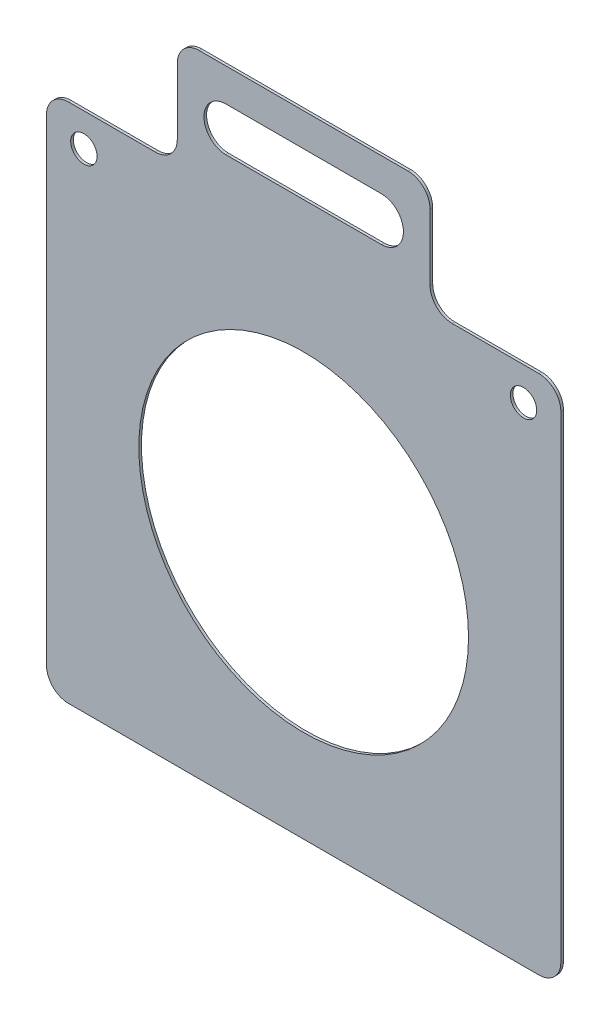
ISO-10303-21;
HEADER;
FILE_DESCRIPTION(('STEP AP214'),'2;1');
FILE_NAME('part.step','',(''),(''),'','','');
FILE_SCHEMA(('AUTOMOTIVE_DESIGN { 1 0 10303 214 1 1 1 1 }'));
ENDSEC;
DATA;
#1=APPLICATION_CONTEXT('core data for automotive mechanical design processes');
#2=APPLICATION_PROTOCOL_DEFINITION('international standard','automotive_design',2000,#1);
#3=PRODUCT_CONTEXT('',#1,'mechanical');
#4=PRODUCT('Part','Part','',(#3));
#5=PRODUCT_RELATED_PRODUCT_CATEGORY('part','',(#4));
#6=PRODUCT_DEFINITION_FORMATION('','',#4);
#7=PRODUCT_DEFINITION_CONTEXT('part definition',#1,'design');
#8=PRODUCT_DEFINITION('design','',#6,#7);
#9=PRODUCT_DEFINITION_SHAPE('','',#8);
#10=(LENGTH_UNIT() NAMED_UNIT(*) SI_UNIT(.MILLI.,.METRE.));
#11=(NAMED_UNIT(*) PLANE_ANGLE_UNIT() SI_UNIT($,.RADIAN.));
#12=(NAMED_UNIT(*) SI_UNIT($,.STERADIAN.) SOLID_ANGLE_UNIT());
#13=UNCERTAINTY_MEASURE_WITH_UNIT(LENGTH_MEASURE(1.E-05),#10,'distance_accuracy_value','');
#14=(GEOMETRIC_REPRESENTATION_CONTEXT(3) GLOBAL_UNCERTAINTY_ASSIGNED_CONTEXT((#13)) GLOBAL_UNIT_ASSIGNED_CONTEXT((#10,
#11,#12)) REPRESENTATION_CONTEXT('',''));
#15=CARTESIAN_POINT('',(0.,0.,0.));
#16=DIRECTION('',(0.,0.,1.));
#17=DIRECTION('',(1.,0.,0.));
#18=AXIS2_PLACEMENT_3D('',#15,#16,#17);
#19=CARTESIAN_POINT('',(-117.,120.000000000001,1.20000000000005));
#20=DIRECTION('',(0.,-1.,0.));
#21=DIRECTION('',(1.,0.,0.));
#22=AXIS2_PLACEMENT_3D('',#19,#20,#21);
#23=PLANE('',#22);
#24=DIRECTION('',(-1.,0.,0.));
#25=VECTOR('',#24,1.);
#26=CARTESIAN_POINT('',(-117.,120.000000000001,1.20000000000005));
#27=LINE('',#26,#25);
#28=CARTESIAN_POINT('',(-67.5000000000001,120.000000000001,1.20000000000005));
#29=VERTEX_POINT('',#28);
#30=CARTESIAN_POINT('',(-107.,120.,1.20000000000005));
#31=VERTEX_POINT('',#30);
#32=EDGE_CURVE('E276',#29,#31,#27,.T.);
#33=ORIENTED_EDGE('',*,*,#32,.F.);
#34=DIRECTION('',(0.,0.,1.));
#35=VECTOR('',#34,1.);
#36=CARTESIAN_POINT('',(-67.5000000000001,120.000000000001,1.20000000000005));
#37=LINE('',#36,#35);
#38=CARTESIAN_POINT('',(-67.5000000000001,120.000000000001,0.));
#39=VERTEX_POINT('',#38);
#40=EDGE_CURVE('E361',#29,#39,#37,.F.);
#41=ORIENTED_EDGE('',*,*,#40,.T.);
#42=DIRECTION('',(-1.,0.,0.));
#43=VECTOR('',#42,1.);
#44=CARTESIAN_POINT('',(-117.,120.000000000001,0.));
#45=LINE('',#44,#43);
#46=CARTESIAN_POINT('',(-107.,120.,0.));
#47=VERTEX_POINT('',#46);
#48=EDGE_CURVE('E291',#39,#47,#45,.T.);
#49=ORIENTED_EDGE('',*,*,#48,.T.);
#50=DIRECTION('',(0.,0.,-1.));
#51=VECTOR('',#50,1.);
#52=CARTESIAN_POINT('',(-107.,120.,1.20000000000005));
#53=LINE('',#52,#51);
#54=EDGE_CURVE('E358',#47,#31,#53,.F.);
#55=ORIENTED_EDGE('',*,*,#54,.T.);
#56=EDGE_LOOP('',(#33,#41,#49,#55));
#57=FACE_BOUND('',#56,.T.);
#58=ADVANCED_FACE('F40',(#57),#23,.F.);
#59=CARTESIAN_POINT('',(0.,0.,1.19999999999998));
#60=DIRECTION('',(0.,0.,1.));
#61=DIRECTION('',(1.,0.,0.));
#62=AXIS2_PLACEMENT_3D('',#59,#60,#61);
#63=PLANE('',#62);
#64=CARTESIAN_POINT('',(-100.,105.,1.20000000000005));
#65=DIRECTION('',(0.,0.,1.));
#66=DIRECTION('',(1.,0.,0.));
#67=AXIS2_PLACEMENT_3D('',#64,#65,#66);
#68=CIRCLE('',#67,6.);
#69=CARTESIAN_POINT('',(-94.0000000000003,105.,1.20000000000005));
#70=VERTEX_POINT('',#69);
#71=EDGE_CURVE('E247',#70,#70,#68,.T.);
#72=ORIENTED_EDGE('',*,*,#71,.F.);
#73=EDGE_LOOP('',(#72));
#74=FACE_BOUND('',#73,.T.);
#75=DIRECTION('',(0.,1.,0.));
#76=VECTOR('',#75,1.);
#77=CARTESIAN_POINT('',(57.5000000000002,170.000000000002,1.19999999999999));
#78=LINE('',#77,#76);
#79=CARTESIAN_POINT('',(57.5000000000003,130.000000000001,1.19999999999999));
#80=VERTEX_POINT('',#79);
#81=CARTESIAN_POINT('',(57.5000000000001,160.000000000002,1.19999999999999));
#82=VERTEX_POINT('',#81);
#83=EDGE_CURVE('E217',#80,#82,#78,.T.);
#84=ORIENTED_EDGE('',*,*,#83,.T.);
#85=CARTESIAN_POINT('',(47.5,160.000000000002,1.20000000000005));
#86=DIRECTION('',(0.,0.,1.));
#87=DIRECTION('',(1.,0.,0.));
#88=AXIS2_PLACEMENT_3D('',#85,#86,#87);
#89=CIRCLE('',#88,10.);
#90=CARTESIAN_POINT('',(47.5000000000002,170.000000000002,1.19999999999999));
#91=VERTEX_POINT('',#90);
#92=EDGE_CURVE('E325',#82,#91,#89,.T.);
#93=ORIENTED_EDGE('',*,*,#92,.T.);
#94=DIRECTION('',(-1.,0.,0.));
#95=VECTOR('',#94,1.);
#96=CARTESIAN_POINT('',(-57.5000000000002,170.000000000002,1.20000000000005));
#97=LINE('',#96,#95);
#98=CARTESIAN_POINT('',(-47.5000000000001,170.000000000002,1.20000000000005));
#99=VERTEX_POINT('',#98);
#100=EDGE_CURVE('E225',#91,#99,#97,.T.);
#101=ORIENTED_EDGE('',*,*,#100,.T.);
#102=CARTESIAN_POINT('',(-47.5,160.000000000002,1.20000000000005));
#103=DIRECTION('',(0.,0.,1.));
#104=DIRECTION('',(1.,0.,0.));
#105=AXIS2_PLACEMENT_3D('',#102,#103,#104);
#106=CIRCLE('',#105,10.);
#107=CARTESIAN_POINT('',(-57.5,160.000000000002,1.20000000000005));
#108=VERTEX_POINT('',#107);
#109=EDGE_CURVE('E322',#99,#108,#106,.T.);
#110=ORIENTED_EDGE('',*,*,#109,.T.);
#111=DIRECTION('',(0.,-1.,0.));
#112=VECTOR('',#111,1.);
#113=CARTESIAN_POINT('',(-57.4999999999999,120.000000000002,1.20000000000005));
#114=LINE('',#113,#112);
#115=CARTESIAN_POINT('',(-57.5000000000001,130.000000000001,1.19999999999998));
#116=VERTEX_POINT('',#115);
#117=EDGE_CURVE('E229',#108,#116,#114,.T.);
#118=ORIENTED_EDGE('',*,*,#117,.T.);
#119=CARTESIAN_POINT('',(-67.5,130.000000000001,1.19999999999998));
#120=DIRECTION('',(0.,0.,1.));
#121=DIRECTION('',(1.,0.,0.));
#122=AXIS2_PLACEMENT_3D('',#119,#120,#121);
#123=CIRCLE('',#122,10.);
#124=EDGE_CURVE('E49',#116,#29,#123,.F.);
#125=ORIENTED_EDGE('',*,*,#124,.T.);
#126=ORIENTED_EDGE('',*,*,#32,.T.);
#127=CARTESIAN_POINT('',(-107.,110.,1.20000000000005));
#128=DIRECTION('',(0.,0.,1.));
#129=DIRECTION('',(1.,0.,0.));
#130=AXIS2_PLACEMENT_3D('',#127,#128,#129);
#131=CIRCLE('',#130,10.);
#132=CARTESIAN_POINT('',(-117.,110.,1.20000000000005));
#133=VERTEX_POINT('',#132);
#134=EDGE_CURVE('E319',#31,#133,#131,.T.);
#135=ORIENTED_EDGE('',*,*,#134,.T.);
#136=DIRECTION('',(0.,-1.,0.));
#137=VECTOR('',#136,1.);
#138=CARTESIAN_POINT('',(-117.,120.000000000001,1.20000000000005));
#139=LINE('',#138,#137);
#140=CARTESIAN_POINT('',(-117.,-107.,1.20000000000003));
#141=VERTEX_POINT('',#140);
#142=EDGE_CURVE('E263',#133,#141,#139,.T.);
#143=ORIENTED_EDGE('',*,*,#142,.T.);
#144=CARTESIAN_POINT('',(-107.,-107.,1.20000000000003));
#145=DIRECTION('',(0.,0.,1.));
#146=DIRECTION('',(1.,0.,0.));
#147=AXIS2_PLACEMENT_3D('',#144,#145,#146);
#148=CIRCLE('',#147,10.);
#149=CARTESIAN_POINT('',(-107.,-117.,1.20000000000003));
#150=VERTEX_POINT('',#149);
#151=EDGE_CURVE('E313',#141,#150,#148,.T.);
#152=ORIENTED_EDGE('',*,*,#151,.T.);
#153=DIRECTION('',(1.,0.,0.));
#154=VECTOR('',#153,1.);
#155=CARTESIAN_POINT('',(-117.,-117.,1.20000000000003));
#156=LINE('',#155,#154);
#157=CARTESIAN_POINT('',(107.,-117.,1.19999999999998));
#158=VERTEX_POINT('',#157);
#159=EDGE_CURVE('E267',#150,#158,#156,.T.);
#160=ORIENTED_EDGE('',*,*,#159,.T.);
#161=CARTESIAN_POINT('',(107.,-107.,1.19999999999998));
#162=DIRECTION('',(0.,0.,1.));
#163=DIRECTION('',(1.,0.,0.));
#164=AXIS2_PLACEMENT_3D('',#161,#162,#163);
#165=CIRCLE('',#164,10.);
#166=CARTESIAN_POINT('',(117.,-107.,1.19999999999998));
#167=VERTEX_POINT('',#166);
#168=EDGE_CURVE('E316',#158,#167,#165,.T.);
#169=ORIENTED_EDGE('',*,*,#168,.T.);
#170=DIRECTION('',(0.,1.,0.));
#171=VECTOR('',#170,1.);
#172=CARTESIAN_POINT('',(117.,120.000000000001,1.19999999999998));
#173=LINE('',#172,#171);
#174=CARTESIAN_POINT('',(117.,110.,1.19999999999998));
#175=VERTEX_POINT('',#174);
#176=EDGE_CURVE('E272',#167,#175,#173,.T.);
#177=ORIENTED_EDGE('',*,*,#176,.T.);
#178=CARTESIAN_POINT('',(107.,110.000000000001,1.19999999999998));
#179=DIRECTION('',(0.,0.,1.));
#180=DIRECTION('',(1.,0.,0.));
#181=AXIS2_PLACEMENT_3D('',#178,#179,#180);
#182=CIRCLE('',#181,10.);
#183=CARTESIAN_POINT('',(107.,120.000000000001,1.19999999999998));
#184=VERTEX_POINT('',#183);
#185=EDGE_CURVE('E310',#175,#184,#182,.T.);
#186=ORIENTED_EDGE('',*,*,#185,.T.);
#187=CARTESIAN_POINT('',(67.5000000000001,120.000000000001,1.19999999999998));
#188=VERTEX_POINT('',#187);
#189=EDGE_CURVE('E280',#184,#188,#27,.T.);
#190=ORIENTED_EDGE('',*,*,#189,.T.);
#191=CARTESIAN_POINT('',(67.5000000000003,130.000000000001,1.19999999999998));
#192=DIRECTION('',(0.,0.,1.));
#193=DIRECTION('',(1.,0.,0.));
#194=AXIS2_PLACEMENT_3D('',#191,#192,#193);
#195=CIRCLE('',#194,10.);
#196=EDGE_CURVE('E384',#188,#80,#195,.F.);
#197=ORIENTED_EDGE('',*,*,#196,.T.);
#198=EDGE_LOOP('',(#84,#93,#101,#110,#118,#125,#126,#135,#143,#152,#160,#169,#177,#186,#190,#197));
#199=FACE_BOUND('',#198,.T.);
#200=CARTESIAN_POINT('',(0.,0.,1.19999999999998));
#201=DIRECTION('',(0.,0.,1.));
#202=DIRECTION('',(1.,0.,0.));
#203=AXIS2_PLACEMENT_3D('',#200,#201,#202);
#204=CIRCLE('',#203,75.);
#205=CARTESIAN_POINT('',(75.0000000000002,0.,1.19999999999998));
#206=VERTEX_POINT('',#205);
#207=EDGE_CURVE('E255',#206,#206,#204,.T.);
#208=ORIENTED_EDGE('',*,*,#207,.F.);
#209=EDGE_LOOP('',(#208));
#210=FACE_BOUND('',#209,.T.);
#211=CARTESIAN_POINT('',(100.,105.000000000001,1.19999999999998));
#212=DIRECTION('',(0.,0.,1.));
#213=DIRECTION('',(-1.,0.,0.));
#214=AXIS2_PLACEMENT_3D('',#211,#212,#213);
#215=CIRCLE('',#214,6.);
#216=CARTESIAN_POINT('',(94.0000000000002,105.000000000001,1.19999999999998));
#217=VERTEX_POINT('',#216);
#218=EDGE_CURVE('E237',#217,#217,#215,.T.);
#219=ORIENTED_EDGE('',*,*,#218,.F.);
#220=EDGE_LOOP('',(#219));
#221=FACE_BOUND('',#220,.T.);
#222=DIRECTION('',(1.,0.,0.));
#223=VECTOR('',#222,1.);
#224=CARTESIAN_POINT('',(-35.3706002300001,134.999999999999,1.20000000000005));
#225=LINE('',#224,#223);
#226=CARTESIAN_POINT('',(-35.3706002300001,134.999999999999,1.20000000000005));
#227=VERTEX_POINT('',#226);
#228=CARTESIAN_POINT('',(35.3706002300002,135.,1.19999999999999));
#229=VERTEX_POINT('',#228);
#230=EDGE_CURVE('E195',#227,#229,#225,.T.);
#231=ORIENTED_EDGE('',*,*,#230,.F.);
#232=CARTESIAN_POINT('',(-35.3706002300002,145.000000000002,1.20000000000005));
#233=DIRECTION('',(0.,0.,1.));
#234=DIRECTION('',(1.,0.,0.));
#235=AXIS2_PLACEMENT_3D('',#232,#233,#234);
#236=CIRCLE('',#235,10.0000000000015);
#237=CARTESIAN_POINT('',(-35.3706002300001,155.000000000002,1.20000000000005));
#238=VERTEX_POINT('',#237);
#239=EDGE_CURVE('E202',#238,#227,#236,.T.);
#240=ORIENTED_EDGE('',*,*,#239,.F.);
#241=DIRECTION('',(-1.,0.,0.));
#242=VECTOR('',#241,1.);
#243=CARTESIAN_POINT('',(-35.3706002300001,155.000000000002,1.20000000000005));
#244=LINE('',#243,#242);
#245=CARTESIAN_POINT('',(35.3706002300001,155.000000000002,1.19999999999999));
#246=VERTEX_POINT('',#245);
#247=EDGE_CURVE('E206',#246,#238,#244,.T.);
#248=ORIENTED_EDGE('',*,*,#247,.F.);
#249=CARTESIAN_POINT('',(35.3706002300001,145.000000000002,1.19999999999999));
#250=DIRECTION('',(0.,0.,1.));
#251=DIRECTION('',(1.,0.,0.));
#252=AXIS2_PLACEMENT_3D('',#249,#250,#251);
#253=CIRCLE('',#252,10.0000000000015);
#254=EDGE_CURVE('E185',#229,#246,#253,.T.);
#255=ORIENTED_EDGE('',*,*,#254,.F.);
#256=EDGE_LOOP('',(#231,#240,#248,#255));
#257=FACE_BOUND('',#256,.T.);
#258=ADVANCED_FACE('F204',(#74,#199,#210,#221,#257),#63,.T.);
#259=CARTESIAN_POINT('',(0.,0.,0.));
#260=DIRECTION('',(0.,0.,1.));
#261=DIRECTION('',(1.,0.,0.));
#262=AXIS2_PLACEMENT_3D('',#259,#260,#261);
#263=PLANE('',#262);
#264=DIRECTION('',(1.,0.,0.));
#265=VECTOR('',#264,1.);
#266=CARTESIAN_POINT('',(-57.5000000000002,170.000000000002,0.));
#267=LINE('',#266,#265);
#268=CARTESIAN_POINT('',(-47.5000000000001,170.000000000002,0.));
#269=VERTEX_POINT('',#268);
#270=CARTESIAN_POINT('',(47.5000000000002,170.000000000002,0.));
#271=VERTEX_POINT('',#270);
#272=EDGE_CURVE('E236',#269,#271,#267,.T.);
#273=ORIENTED_EDGE('',*,*,#272,.T.);
#274=CARTESIAN_POINT('',(47.5,160.000000000002,0.));
#275=DIRECTION('',(0.,0.,1.));
#276=DIRECTION('',(1.,0.,0.));
#277=AXIS2_PLACEMENT_3D('',#274,#275,#276);
#278=CIRCLE('',#277,10.);
#279=CARTESIAN_POINT('',(57.5000000000001,160.000000000002,0.));
#280=VERTEX_POINT('',#279);
#281=EDGE_CURVE('E348',#271,#280,#278,.F.);
#282=ORIENTED_EDGE('',*,*,#281,.T.);
#283=DIRECTION('',(0.,-1.,0.));
#284=VECTOR('',#283,1.);
#285=CARTESIAN_POINT('',(57.5000000000002,170.000000000002,0.));
#286=LINE('',#285,#284);
#287=CARTESIAN_POINT('',(57.5000000000003,130.000000000001,0.));
#288=VERTEX_POINT('',#287);
#289=EDGE_CURVE('E246',#280,#288,#286,.T.);
#290=ORIENTED_EDGE('',*,*,#289,.T.);
#291=CARTESIAN_POINT('',(67.5000000000003,130.000000000001,0.));
#292=DIRECTION('',(0.,0.,1.));
#293=DIRECTION('',(1.,0.,0.));
#294=AXIS2_PLACEMENT_3D('',#291,#292,#293);
#295=CIRCLE('',#294,10.);
#296=CARTESIAN_POINT('',(67.5000000000001,120.000000000001,0.));
#297=VERTEX_POINT('',#296);
#298=EDGE_CURVE('E387',#288,#297,#295,.T.);
#299=ORIENTED_EDGE('',*,*,#298,.T.);
#300=CARTESIAN_POINT('',(107.,120.000000000001,0.));
#301=VERTEX_POINT('',#300);
#302=EDGE_CURVE('E268',#301,#297,#45,.T.);
#303=ORIENTED_EDGE('',*,*,#302,.F.);
#304=CARTESIAN_POINT('',(107.,110.000000000001,0.));
#305=DIRECTION('',(0.,0.,1.));
#306=DIRECTION('',(1.,0.,0.));
#307=AXIS2_PLACEMENT_3D('',#304,#305,#306);
#308=CIRCLE('',#307,10.);
#309=CARTESIAN_POINT('',(117.,110.,0.));
#310=VERTEX_POINT('',#309);
#311=EDGE_CURVE('E335',#301,#310,#308,.F.);
#312=ORIENTED_EDGE('',*,*,#311,.T.);
#313=DIRECTION('',(0.,1.,0.));
#314=VECTOR('',#313,1.);
#315=CARTESIAN_POINT('',(117.,120.000000000001,0.));
#316=LINE('',#315,#314);
#317=CARTESIAN_POINT('',(117.,-107.,0.));
#318=VERTEX_POINT('',#317);
#319=EDGE_CURVE('E287',#318,#310,#316,.T.);
#320=ORIENTED_EDGE('',*,*,#319,.F.);
#321=CARTESIAN_POINT('',(107.,-107.,0.));
#322=DIRECTION('',(0.,0.,1.));
#323=DIRECTION('',(1.,0.,0.));
#324=AXIS2_PLACEMENT_3D('',#321,#322,#323);
#325=CIRCLE('',#324,10.);
#326=CARTESIAN_POINT('',(107.,-117.,0.));
#327=VERTEX_POINT('',#326);
#328=EDGE_CURVE('E56',#318,#327,#325,.F.);
#329=ORIENTED_EDGE('',*,*,#328,.T.);
#330=DIRECTION('',(1.,0.,0.));
#331=VECTOR('',#330,1.);
#332=CARTESIAN_POINT('',(-117.,-117.,0.));
#333=LINE('',#332,#331);
#334=CARTESIAN_POINT('',(-107.,-117.,0.));
#335=VERTEX_POINT('',#334);
#336=EDGE_CURVE('E284',#335,#327,#333,.T.);
#337=ORIENTED_EDGE('',*,*,#336,.F.);
#338=CARTESIAN_POINT('',(-107.,-107.,0.));
#339=DIRECTION('',(0.,0.,1.));
#340=DIRECTION('',(1.,0.,0.));
#341=AXIS2_PLACEMENT_3D('',#338,#339,#340);
#342=CIRCLE('',#341,10.);
#343=CARTESIAN_POINT('',(-117.,-107.,0.));
#344=VERTEX_POINT('',#343);
#345=EDGE_CURVE('E64',#335,#344,#342,.F.);
#346=ORIENTED_EDGE('',*,*,#345,.T.);
#347=DIRECTION('',(0.,-1.,0.));
#348=VECTOR('',#347,1.);
#349=CARTESIAN_POINT('',(-117.,120.000000000001,0.));
#350=LINE('',#349,#348);
#351=CARTESIAN_POINT('',(-117.,110.,0.));
#352=VERTEX_POINT('',#351);
#353=EDGE_CURVE('E259',#352,#344,#350,.T.);
#354=ORIENTED_EDGE('',*,*,#353,.F.);
#355=CARTESIAN_POINT('',(-107.,110.,0.));
#356=DIRECTION('',(0.,0.,1.));
#357=DIRECTION('',(1.,0.,0.));
#358=AXIS2_PLACEMENT_3D('',#355,#356,#357);
#359=CIRCLE('',#358,10.);
#360=EDGE_CURVE('E342',#352,#47,#359,.F.);
#361=ORIENTED_EDGE('',*,*,#360,.T.);
#362=ORIENTED_EDGE('',*,*,#48,.F.);
#363=CARTESIAN_POINT('',(-67.5,130.000000000001,0.));
#364=DIRECTION('',(0.,0.,1.));
#365=DIRECTION('',(1.,0.,0.));
#366=AXIS2_PLACEMENT_3D('',#363,#364,#365);
#367=CIRCLE('',#366,10.);
#368=CARTESIAN_POINT('',(-57.5000000000001,130.000000000001,0.));
#369=VERTEX_POINT('',#368);
#370=EDGE_CURVE('E11',#39,#369,#367,.T.);
#371=ORIENTED_EDGE('',*,*,#370,.T.);
#372=DIRECTION('',(0.,1.,0.));
#373=VECTOR('',#372,1.);
#374=CARTESIAN_POINT('',(-57.4999999999999,120.000000000002,0.));
#375=LINE('',#374,#373);
#376=CARTESIAN_POINT('',(-57.5,160.000000000002,0.));
#377=VERTEX_POINT('',#376);
#378=EDGE_CURVE('E410',#369,#377,#375,.T.);
#379=ORIENTED_EDGE('',*,*,#378,.T.);
#380=CARTESIAN_POINT('',(-47.5,160.000000000002,0.));
#381=DIRECTION('',(0.,0.,1.));
#382=DIRECTION('',(1.,0.,0.));
#383=AXIS2_PLACEMENT_3D('',#380,#381,#382);
#384=CIRCLE('',#383,10.);
#385=EDGE_CURVE('E345',#377,#269,#384,.F.);
#386=ORIENTED_EDGE('',*,*,#385,.T.);
#387=EDGE_LOOP('',(#273,#282,#290,#299,#303,#312,#320,#329,#337,#346,#354,#361,#362,#371,#379,#386));
#388=FACE_BOUND('',#387,.T.);
#389=CARTESIAN_POINT('',(0.,0.,0.));
#390=DIRECTION('',(0.,0.,1.));
#391=DIRECTION('',(1.,0.,0.));
#392=AXIS2_PLACEMENT_3D('',#389,#390,#391);
#393=CIRCLE('',#392,75.);
#394=CARTESIAN_POINT('',(75.0000000000002,0.,0.));
#395=VERTEX_POINT('',#394);
#396=EDGE_CURVE('E251',#395,#395,#393,.T.);
#397=ORIENTED_EDGE('',*,*,#396,.T.);
#398=EDGE_LOOP('',(#397));
#399=FACE_BOUND('',#398,.T.);
#400=CARTESIAN_POINT('',(-100.,105.,0.));
#401=DIRECTION('',(0.,0.,1.));
#402=DIRECTION('',(1.,0.,0.));
#403=AXIS2_PLACEMENT_3D('',#400,#401,#402);
#404=CIRCLE('',#403,6.);
#405=CARTESIAN_POINT('',(-94.0000000000003,105.,0.));
#406=VERTEX_POINT('',#405);
#407=EDGE_CURVE('E241',#406,#406,#404,.T.);
#408=ORIENTED_EDGE('',*,*,#407,.T.);
#409=EDGE_LOOP('',(#408));
#410=FACE_BOUND('',#409,.T.);
#411=CARTESIAN_POINT('',(100.,105.000000000001,0.));
#412=DIRECTION('',(0.,0.,1.));
#413=DIRECTION('',(-1.,0.,0.));
#414=AXIS2_PLACEMENT_3D('',#411,#412,#413);
#415=CIRCLE('',#414,6.);
#416=CARTESIAN_POINT('',(94.0000000000002,105.000000000001,0.));
#417=VERTEX_POINT('',#416);
#418=EDGE_CURVE('E242',#417,#417,#415,.T.);
#419=ORIENTED_EDGE('',*,*,#418,.T.);
#420=EDGE_LOOP('',(#419));
#421=FACE_BOUND('',#420,.T.);
#422=DIRECTION('',(-1.,0.,0.));
#423=VECTOR('',#422,1.);
#424=CARTESIAN_POINT('',(-35.3706002300001,134.999999999999,0.));
#425=LINE('',#424,#423);
#426=CARTESIAN_POINT('',(35.3706002300001,134.999999999999,0.));
#427=VERTEX_POINT('',#426);
#428=CARTESIAN_POINT('',(-35.3706002300001,134.999999999999,0.));
#429=VERTEX_POINT('',#428);
#430=EDGE_CURVE('E233',#427,#429,#425,.T.);
#431=ORIENTED_EDGE('',*,*,#430,.F.);
#432=CARTESIAN_POINT('',(35.3706002300001,145.000000000002,0.));
#433=DIRECTION('',(0.,0.,1.));
#434=DIRECTION('',(1.,0.,0.));
#435=AXIS2_PLACEMENT_3D('',#432,#433,#434);
#436=CIRCLE('',#435,10.0000000000015);
#437=CARTESIAN_POINT('',(35.3706002300001,155.000000000004,0.));
#438=VERTEX_POINT('',#437);
#439=EDGE_CURVE('E187',#438,#427,#436,.F.);
#440=ORIENTED_EDGE('',*,*,#439,.F.);
#441=DIRECTION('',(1.,0.,0.));
#442=VECTOR('',#441,1.);
#443=CARTESIAN_POINT('',(-35.3706002300001,155.000000000002,0.));
#444=LINE('',#443,#442);
#445=CARTESIAN_POINT('',(-35.3706002300001,155.000000000002,0.));
#446=VERTEX_POINT('',#445);
#447=EDGE_CURVE('E420',#446,#438,#444,.T.);
#448=ORIENTED_EDGE('',*,*,#447,.F.);
#449=CARTESIAN_POINT('',(-35.3706002300002,145.000000000002,0.));
#450=DIRECTION('',(0.,0.,1.));
#451=DIRECTION('',(1.,0.,0.));
#452=AXIS2_PLACEMENT_3D('',#449,#450,#451);
#453=CIRCLE('',#452,10.0000000000015);
#454=EDGE_CURVE('E415',#429,#446,#453,.F.);
#455=ORIENTED_EDGE('',*,*,#454,.F.);
#456=EDGE_LOOP('',(#431,#440,#448,#455));
#457=FACE_BOUND('',#456,.T.);
#458=ADVANCED_FACE('F408',(#388,#399,#410,#421,#457),#263,.F.);
#459=CARTESIAN_POINT('',(-117.,120.000000000001,1.20000000000005));
#460=DIRECTION('',(1.,0.,0.));
#461=DIRECTION('',(0.,1.,0.));
#462=AXIS2_PLACEMENT_3D('',#459,#460,#461);
#463=PLANE('',#462);
#464=ORIENTED_EDGE('',*,*,#142,.F.);
#465=DIRECTION('',(0.,0.,-1.));
#466=VECTOR('',#465,1.);
#467=CARTESIAN_POINT('',(-117.,110.,1.20000000000005));
#468=LINE('',#467,#466);
#469=EDGE_CURVE('E367',#133,#352,#468,.T.);
#470=ORIENTED_EDGE('',*,*,#469,.T.);
#471=ORIENTED_EDGE('',*,*,#353,.T.);
#472=DIRECTION('',(0.,0.,-1.));
#473=VECTOR('',#472,1.);
#474=CARTESIAN_POINT('',(-117.,-107.,1.20000000000003));
#475=LINE('',#474,#473);
#476=EDGE_CURVE('E364',#344,#141,#475,.F.);
#477=ORIENTED_EDGE('',*,*,#476,.T.);
#478=EDGE_LOOP('',(#464,#470,#471,#477));
#479=FACE_BOUND('',#478,.T.);
#480=ADVANCED_FACE('F482',(#479),#463,.F.);
#481=CARTESIAN_POINT('',(-117.,-117.,1.20000000000003));
#482=DIRECTION('',(0.,1.,0.));
#483=DIRECTION('',(-1.,0.,0.));
#484=AXIS2_PLACEMENT_3D('',#481,#482,#483);
#485=PLANE('',#484);
#486=ORIENTED_EDGE('',*,*,#336,.T.);
#487=DIRECTION('',(0.,0.,-1.));
#488=VECTOR('',#487,1.);
#489=CARTESIAN_POINT('',(107.,-117.,1.19999999999998));
#490=LINE('',#489,#488);
#491=EDGE_CURVE('E381',#327,#158,#490,.F.);
#492=ORIENTED_EDGE('',*,*,#491,.T.);
#493=ORIENTED_EDGE('',*,*,#159,.F.);
#494=DIRECTION('',(0.,0.,-1.));
#495=VECTOR('',#494,1.);
#496=CARTESIAN_POINT('',(-107.,-117.,1.20000000000003));
#497=LINE('',#496,#495);
#498=EDGE_CURVE('E378',#150,#335,#497,.T.);
#499=ORIENTED_EDGE('',*,*,#498,.T.);
#500=EDGE_LOOP('',(#486,#492,#493,#499));
#501=FACE_BOUND('',#500,.T.);
#502=ADVANCED_FACE('F476',(#501),#485,.F.);
#503=CARTESIAN_POINT('',(117.,120.000000000001,1.19999999999998));
#504=DIRECTION('',(-1.,0.,0.));
#505=DIRECTION('',(0.,-1.,0.));
#506=AXIS2_PLACEMENT_3D('',#503,#504,#505);
#507=PLANE('',#506);
#508=ORIENTED_EDGE('',*,*,#176,.F.);
#509=DIRECTION('',(0.,0.,-1.));
#510=VECTOR('',#509,1.);
#511=CARTESIAN_POINT('',(117.,-107.,1.19999999999998));
#512=LINE('',#511,#510);
#513=EDGE_CURVE('E374',#167,#318,#512,.T.);
#514=ORIENTED_EDGE('',*,*,#513,.T.);
#515=ORIENTED_EDGE('',*,*,#319,.T.);
#516=DIRECTION('',(0.,0.,-1.));
#517=VECTOR('',#516,1.);
#518=CARTESIAN_POINT('',(117.,110.,1.19999999999998));
#519=LINE('',#518,#517);
#520=EDGE_CURVE('E371',#310,#175,#519,.F.);
#521=ORIENTED_EDGE('',*,*,#520,.T.);
#522=EDGE_LOOP('',(#508,#514,#515,#521));
#523=FACE_BOUND('',#522,.T.);
#524=ADVANCED_FACE('F468',(#523),#507,.F.);
#525=ORIENTED_EDGE('',*,*,#302,.T.);
#526=DIRECTION('',(0.,0.,1.));
#527=VECTOR('',#526,1.);
#528=CARTESIAN_POINT('',(67.5000000000003,120.,1.19999999999998));
#529=LINE('',#528,#527);
#530=EDGE_CURVE('E299',#297,#188,#529,.T.);
#531=ORIENTED_EDGE('',*,*,#530,.T.);
#532=ORIENTED_EDGE('',*,*,#189,.F.);
#533=DIRECTION('',(0.,0.,-1.));
#534=VECTOR('',#533,1.);
#535=CARTESIAN_POINT('',(107.,120.000000000001,1.19999999999998));
#536=LINE('',#535,#534);
#537=EDGE_CURVE('E295',#184,#301,#536,.T.);
#538=ORIENTED_EDGE('',*,*,#537,.T.);
#539=EDGE_LOOP('',(#525,#531,#532,#538));
#540=FACE_BOUND('',#539,.T.);
#541=ADVANCED_FACE('F457',(#540),#23,.F.);
#542=CARTESIAN_POINT('',(0.,0.,1.19999999999998));
#543=DIRECTION('',(0.,0.,-1.));
#544=DIRECTION('',(-1.,0.,0.));
#545=AXIS2_PLACEMENT_3D('',#542,#543,#544);
#546=CYLINDRICAL_SURFACE('',#545,75.);
#547=ORIENTED_EDGE('',*,*,#207,.T.);
#548=EDGE_LOOP('',(#547));
#549=FACE_BOUND('',#548,.T.);
#550=ORIENTED_EDGE('',*,*,#396,.F.);
#551=EDGE_LOOP('',(#550));
#552=FACE_BOUND('',#551,.T.);
#553=ADVANCED_FACE('F505',(#549,#552),#546,.F.);
#554=CARTESIAN_POINT('',(-100.,105.,1.20000000000005));
#555=DIRECTION('',(0.,0.,-1.));
#556=DIRECTION('',(-1.,0.,0.));
#557=AXIS2_PLACEMENT_3D('',#554,#555,#556);
#558=CYLINDRICAL_SURFACE('',#557,6.);
#559=ORIENTED_EDGE('',*,*,#71,.T.);
#560=EDGE_LOOP('',(#559));
#561=FACE_BOUND('',#560,.T.);
#562=ORIENTED_EDGE('',*,*,#407,.F.);
#563=EDGE_LOOP('',(#562));
#564=FACE_BOUND('',#563,.T.);
#565=ADVANCED_FACE('F510',(#561,#564),#558,.F.);
#566=CARTESIAN_POINT('',(100.,105.000000000001,1.19999999999998));
#567=DIRECTION('',(0.,0.,-1.));
#568=DIRECTION('',(-1.,0.,0.));
#569=AXIS2_PLACEMENT_3D('',#566,#567,#568);
#570=CYLINDRICAL_SURFACE('',#569,6.);
#571=ORIENTED_EDGE('',*,*,#218,.T.);
#572=EDGE_LOOP('',(#571));
#573=FACE_BOUND('',#572,.T.);
#574=ORIENTED_EDGE('',*,*,#418,.F.);
#575=EDGE_LOOP('',(#574));
#576=FACE_BOUND('',#575,.T.);
#577=ADVANCED_FACE('F538',(#573,#576),#570,.F.);
#578=CARTESIAN_POINT('',(57.5000000000002,170.000000000002,-125.399362039844));
#579=DIRECTION('',(1.,0.,0.));
#580=DIRECTION('',(0.,1.,0.));
#581=AXIS2_PLACEMENT_3D('',#578,#579,#580);
#582=PLANE('',#581);
#583=ORIENTED_EDGE('',*,*,#83,.F.);
#584=DIRECTION('',(0.,0.,1.));
#585=VECTOR('',#584,1.);
#586=CARTESIAN_POINT('',(57.5000000000003,130.000000000001,-125.399362039844));
#587=LINE('',#586,#585);
#588=EDGE_CURVE('E307',#80,#288,#587,.F.);
#589=ORIENTED_EDGE('',*,*,#588,.T.);
#590=ORIENTED_EDGE('',*,*,#289,.F.);
#591=DIRECTION('',(0.,0.,1.));
#592=VECTOR('',#591,1.);
#593=CARTESIAN_POINT('',(57.5000000000002,160.000000000002,-125.399362039844));
#594=LINE('',#593,#592);
#595=EDGE_CURVE('E303',#280,#82,#594,.T.);
#596=ORIENTED_EDGE('',*,*,#595,.T.);
#597=EDGE_LOOP('',(#583,#589,#590,#596));
#598=FACE_BOUND('',#597,.T.);
#599=ADVANCED_FACE('F536',(#598),#582,.T.);
#600=CARTESIAN_POINT('',(-57.5000000000003,170.000000000002,-125.399362039845));
#601=DIRECTION('',(0.,1.,0.));
#602=DIRECTION('',(0.,0.,1.));
#603=AXIS2_PLACEMENT_3D('',#600,#601,#602);
#604=PLANE('',#603);
#605=ORIENTED_EDGE('',*,*,#100,.F.);
#606=DIRECTION('',(0.,0.,1.));
#607=VECTOR('',#606,1.);
#608=CARTESIAN_POINT('',(47.5000000000002,170.000000000002,-125.399362039844));
#609=LINE('',#608,#607);
#610=EDGE_CURVE('E332',#91,#271,#609,.F.);
#611=ORIENTED_EDGE('',*,*,#610,.T.);
#612=ORIENTED_EDGE('',*,*,#272,.F.);
#613=DIRECTION('',(0.,0.,1.));
#614=VECTOR('',#613,1.);
#615=CARTESIAN_POINT('',(-47.5000000000002,170.000000000002,-125.399362039845));
#616=LINE('',#615,#614);
#617=EDGE_CURVE('E328',#269,#99,#616,.T.);
#618=ORIENTED_EDGE('',*,*,#617,.T.);
#619=EDGE_LOOP('',(#605,#611,#612,#618));
#620=FACE_BOUND('',#619,.T.);
#621=ADVANCED_FACE('F534',(#620),#604,.T.);
#622=CARTESIAN_POINT('',(-57.4999999999999,120.000000000002,-125.399362039845));
#623=DIRECTION('',(-1.,0.,0.));
#624=DIRECTION('',(0.,0.,1.));
#625=AXIS2_PLACEMENT_3D('',#622,#623,#624);
#626=PLANE('',#625);
#627=ORIENTED_EDGE('',*,*,#117,.F.);
#628=DIRECTION('',(0.,0.,1.));
#629=VECTOR('',#628,1.);
#630=CARTESIAN_POINT('',(-57.5000000000002,160.000000000002,-125.399362039845));
#631=LINE('',#630,#629);
#632=EDGE_CURVE('E355',#108,#377,#631,.F.);
#633=ORIENTED_EDGE('',*,*,#632,.T.);
#634=ORIENTED_EDGE('',*,*,#378,.F.);
#635=DIRECTION('',(0.,0.,1.));
#636=VECTOR('',#635,1.);
#637=CARTESIAN_POINT('',(-57.5000000000003,130.000000000001,-125.399362039845));
#638=LINE('',#637,#636);
#639=EDGE_CURVE('E351',#369,#116,#638,.T.);
#640=ORIENTED_EDGE('',*,*,#639,.T.);
#641=EDGE_LOOP('',(#627,#633,#634,#640));
#642=FACE_BOUND('',#641,.T.);
#643=ADVANCED_FACE('F413',(#642),#626,.T.);
#644=CARTESIAN_POINT('',(-35.3706002300003,134.999999999999,-125.399362039845));
#645=DIRECTION('',(0.,-1.,0.));
#646=DIRECTION('',(0.,0.,-1.));
#647=AXIS2_PLACEMENT_3D('',#644,#645,#646);
#648=PLANE('',#647);
#649=DIRECTION('',(0.,0.,1.));
#650=VECTOR('',#649,1.);
#651=CARTESIAN_POINT('',(35.3706002300001,135.,-125.399362039845));
#652=LINE('',#651,#650);
#653=EDGE_CURVE('E180',#427,#229,#652,.T.);
#654=ORIENTED_EDGE('',*,*,#653,.F.);
#655=ORIENTED_EDGE('',*,*,#430,.T.);
#656=DIRECTION('',(0.,0.,1.));
#657=VECTOR('',#656,1.);
#658=CARTESIAN_POINT('',(-35.3706002300003,134.999999999999,-125.399362039845));
#659=LINE('',#658,#657);
#660=EDGE_CURVE('E192',#429,#227,#659,.T.);
#661=ORIENTED_EDGE('',*,*,#660,.T.);
#662=ORIENTED_EDGE('',*,*,#230,.T.);
#663=EDGE_LOOP('',(#654,#655,#661,#662));
#664=FACE_BOUND('',#663,.T.);
#665=ADVANCED_FACE('F196',(#664),#648,.F.);
#666=CARTESIAN_POINT('',(35.3706002300001,145.000000000002,-125.399362039845));
#667=DIRECTION('',(0.,0.,1.));
#668=DIRECTION('',(1.,0.,0.));
#669=AXIS2_PLACEMENT_3D('',#666,#667,#668);
#670=CYLINDRICAL_SURFACE('',#669,10.0000000000015);
#671=DIRECTION('',(0.,0.,1.));
#672=VECTOR('',#671,1.);
#673=CARTESIAN_POINT('',(35.3706002300001,155.000000000002,-125.399362039844));
#674=LINE('',#673,#672);
#675=EDGE_CURVE('E191',#438,#246,#674,.T.);
#676=ORIENTED_EDGE('',*,*,#675,.F.);
#677=ORIENTED_EDGE('',*,*,#439,.T.);
#678=ORIENTED_EDGE('',*,*,#653,.T.);
#679=ORIENTED_EDGE('',*,*,#254,.T.);
#680=EDGE_LOOP('',(#676,#677,#678,#679));
#681=FACE_BOUND('',#680,.T.);
#682=ADVANCED_FACE('F183',(#681),#670,.F.);
#683=CARTESIAN_POINT('',(-35.3706002300002,155.000000000002,-125.399362039845));
#684=DIRECTION('',(0.,1.,0.));
#685=DIRECTION('',(0.,0.,1.));
#686=AXIS2_PLACEMENT_3D('',#683,#684,#685);
#687=PLANE('',#686);
#688=DIRECTION('',(0.,0.,1.));
#689=VECTOR('',#688,1.);
#690=CARTESIAN_POINT('',(-35.3706002300002,155.000000000002,-125.399362039845));
#691=LINE('',#690,#689);
#692=EDGE_CURVE('E214',#446,#238,#691,.T.);
#693=ORIENTED_EDGE('',*,*,#692,.F.);
#694=ORIENTED_EDGE('',*,*,#447,.T.);
#695=ORIENTED_EDGE('',*,*,#675,.T.);
#696=ORIENTED_EDGE('',*,*,#247,.T.);
#697=EDGE_LOOP('',(#693,#694,#695,#696));
#698=FACE_BOUND('',#697,.T.);
#699=ADVANCED_FACE('F433',(#698),#687,.F.);
#700=CARTESIAN_POINT('',(-35.3706002300002,145.000000000002,-125.399362039845));
#701=DIRECTION('',(0.,0.,1.));
#702=DIRECTION('',(1.,0.,0.));
#703=AXIS2_PLACEMENT_3D('',#700,#701,#702);
#704=CYLINDRICAL_SURFACE('',#703,10.0000000000015);
#705=ORIENTED_EDGE('',*,*,#660,.F.);
#706=ORIENTED_EDGE('',*,*,#454,.T.);
#707=ORIENTED_EDGE('',*,*,#692,.T.);
#708=ORIENTED_EDGE('',*,*,#239,.T.);
#709=EDGE_LOOP('',(#705,#706,#707,#708));
#710=FACE_BOUND('',#709,.T.);
#711=ADVANCED_FACE('F429',(#710),#704,.F.);
#712=CARTESIAN_POINT('',(67.5000000000003,130.000000000001,1.19999999999998));
#713=DIRECTION('',(0.,0.,1.));
#714=DIRECTION('',(1.,0.,0.));
#715=AXIS2_PLACEMENT_3D('',#712,#713,#714);
#716=CYLINDRICAL_SURFACE('',#715,10.);
#717=ORIENTED_EDGE('',*,*,#298,.F.);
#718=ORIENTED_EDGE('',*,*,#588,.F.);
#719=ORIENTED_EDGE('',*,*,#196,.F.);
#720=ORIENTED_EDGE('',*,*,#530,.F.);
#721=EDGE_LOOP('',(#717,#718,#719,#720));
#722=FACE_BOUND('',#721,.T.);
#723=ADVANCED_FACE('F453',(#722),#716,.F.);
#724=CARTESIAN_POINT('',(47.5,160.000000000002,-125.399362039844));
#725=DIRECTION('',(0.,0.,1.));
#726=DIRECTION('',(1.,0.,0.));
#727=AXIS2_PLACEMENT_3D('',#724,#725,#726);
#728=CYLINDRICAL_SURFACE('',#727,10.);
#729=ORIENTED_EDGE('',*,*,#281,.F.);
#730=ORIENTED_EDGE('',*,*,#610,.F.);
#731=ORIENTED_EDGE('',*,*,#92,.F.);
#732=ORIENTED_EDGE('',*,*,#595,.F.);
#733=EDGE_LOOP('',(#729,#730,#731,#732));
#734=FACE_BOUND('',#733,.T.);
#735=ADVANCED_FACE('F522',(#734),#728,.T.);
#736=CARTESIAN_POINT('',(-47.5000000000001,160.000000000002,-125.399362039845));
#737=DIRECTION('',(0.,0.,1.));
#738=DIRECTION('',(1.,0.,0.));
#739=AXIS2_PLACEMENT_3D('',#736,#737,#738);
#740=CYLINDRICAL_SURFACE('',#739,10.);
#741=ORIENTED_EDGE('',*,*,#385,.F.);
#742=ORIENTED_EDGE('',*,*,#632,.F.);
#743=ORIENTED_EDGE('',*,*,#109,.F.);
#744=ORIENTED_EDGE('',*,*,#617,.F.);
#745=EDGE_LOOP('',(#741,#742,#743,#744));
#746=FACE_BOUND('',#745,.T.);
#747=ADVANCED_FACE('F493',(#746),#740,.T.);
#748=CARTESIAN_POINT('',(-67.5000000000003,130.000000000001,-125.399362039845));
#749=DIRECTION('',(0.,0.,1.));
#750=DIRECTION('',(1.,0.,0.));
#751=AXIS2_PLACEMENT_3D('',#748,#749,#750);
#752=CYLINDRICAL_SURFACE('',#751,10.);
#753=ORIENTED_EDGE('',*,*,#370,.F.);
#754=ORIENTED_EDGE('',*,*,#40,.F.);
#755=ORIENTED_EDGE('',*,*,#124,.F.);
#756=ORIENTED_EDGE('',*,*,#639,.F.);
#757=EDGE_LOOP('',(#753,#754,#755,#756));
#758=FACE_BOUND('',#757,.T.);
#759=ADVANCED_FACE('F404',(#758),#752,.F.);
#760=CARTESIAN_POINT('',(-107.,110.,1.20000000000005));
#761=DIRECTION('',(0.,0.,-1.));
#762=DIRECTION('',(-1.,0.,0.));
#763=AXIS2_PLACEMENT_3D('',#760,#761,#762);
#764=CYLINDRICAL_SURFACE('',#763,10.);
#765=ORIENTED_EDGE('',*,*,#134,.F.);
#766=ORIENTED_EDGE('',*,*,#54,.F.);
#767=ORIENTED_EDGE('',*,*,#360,.F.);
#768=ORIENTED_EDGE('',*,*,#469,.F.);
#769=EDGE_LOOP('',(#765,#766,#767,#768));
#770=FACE_BOUND('',#769,.T.);
#771=ADVANCED_FACE('F485',(#770),#764,.T.);
#772=CARTESIAN_POINT('',(107.,-107.,1.19999999999998));
#773=DIRECTION('',(0.,0.,-1.));
#774=DIRECTION('',(-1.,0.,0.));
#775=AXIS2_PLACEMENT_3D('',#772,#773,#774);
#776=CYLINDRICAL_SURFACE('',#775,10.);
#777=ORIENTED_EDGE('',*,*,#168,.F.);
#778=ORIENTED_EDGE('',*,*,#491,.F.);
#779=ORIENTED_EDGE('',*,*,#328,.F.);
#780=ORIENTED_EDGE('',*,*,#513,.F.);
#781=EDGE_LOOP('',(#777,#778,#779,#780));
#782=FACE_BOUND('',#781,.T.);
#783=ADVANCED_FACE('F472',(#782),#776,.T.);
#784=CARTESIAN_POINT('',(-107.,-107.,1.20000000000003));
#785=DIRECTION('',(0.,0.,-1.));
#786=DIRECTION('',(-1.,0.,0.));
#787=AXIS2_PLACEMENT_3D('',#784,#785,#786);
#788=CYLINDRICAL_SURFACE('',#787,10.);
#789=ORIENTED_EDGE('',*,*,#151,.F.);
#790=ORIENTED_EDGE('',*,*,#476,.F.);
#791=ORIENTED_EDGE('',*,*,#345,.F.);
#792=ORIENTED_EDGE('',*,*,#498,.F.);
#793=EDGE_LOOP('',(#789,#790,#791,#792));
#794=FACE_BOUND('',#793,.T.);
#795=ADVANCED_FACE('F479',(#794),#788,.T.);
#796=CARTESIAN_POINT('',(107.,110.000000000001,1.19999999999998));
#797=DIRECTION('',(0.,0.,-1.));
#798=DIRECTION('',(-1.,0.,0.));
#799=AXIS2_PLACEMENT_3D('',#796,#797,#798);
#800=CYLINDRICAL_SURFACE('',#799,10.);
#801=ORIENTED_EDGE('',*,*,#185,.F.);
#802=ORIENTED_EDGE('',*,*,#520,.F.);
#803=ORIENTED_EDGE('',*,*,#311,.F.);
#804=ORIENTED_EDGE('',*,*,#537,.F.);
#805=EDGE_LOOP('',(#801,#802,#803,#804));
#806=FACE_BOUND('',#805,.T.);
#807=ADVANCED_FACE('F42',(#806),#800,.T.);
#808=CLOSED_SHELL('',(#58,#258,#458,#480,#502,#524,#541,#553,#565,#577,#599,#621,#643,#665,#682,
#699,#711,#723,#735,#747,#759,#771,#783,#795,#807));
#809=MANIFOLD_SOLID_BREP('B2',#808);
#810=ADVANCED_BREP_SHAPE_REPRESENTATION('',(#18,#809),#14);
#811=SHAPE_DEFINITION_REPRESENTATION(#9,#810);
ENDSEC;
END-ISO-10303-21;
